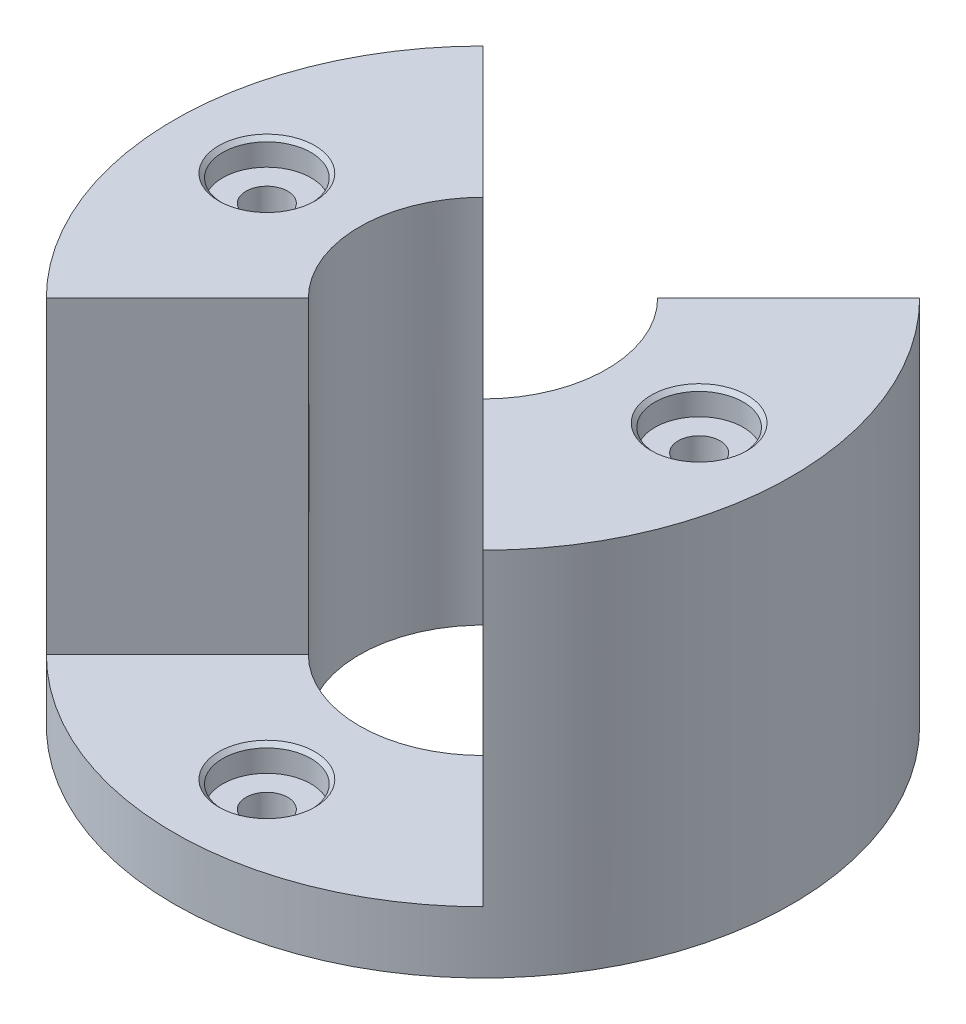
ISO-10303-21;
HEADER;
FILE_DESCRIPTION(('STEP AP214'),'2;1');
FILE_NAME('part.step','',(''),(''),'','','');
FILE_SCHEMA(('AUTOMOTIVE_DESIGN { 1 0 10303 214 1 1 1 1 }'));
ENDSEC;
DATA;
#1=APPLICATION_CONTEXT('core data for automotive mechanical design processes');
#2=APPLICATION_PROTOCOL_DEFINITION('international standard','automotive_design',2000,#1);
#3=PRODUCT_CONTEXT('',#1,'mechanical');
#4=PRODUCT('Part','Part','',(#3));
#5=PRODUCT_RELATED_PRODUCT_CATEGORY('part','',(#4));
#6=PRODUCT_DEFINITION_FORMATION('','',#4);
#7=PRODUCT_DEFINITION_CONTEXT('part definition',#1,'design');
#8=PRODUCT_DEFINITION('design','',#6,#7);
#9=PRODUCT_DEFINITION_SHAPE('','',#8);
#10=(LENGTH_UNIT() NAMED_UNIT(*) SI_UNIT(.MILLI.,.METRE.));
#11=(NAMED_UNIT(*) PLANE_ANGLE_UNIT() SI_UNIT($,.RADIAN.));
#12=(NAMED_UNIT(*) SI_UNIT($,.STERADIAN.) SOLID_ANGLE_UNIT());
#13=UNCERTAINTY_MEASURE_WITH_UNIT(LENGTH_MEASURE(1.E-05),#10,'distance_accuracy_value','');
#14=(GEOMETRIC_REPRESENTATION_CONTEXT(3) GLOBAL_UNCERTAINTY_ASSIGNED_CONTEXT((#13)) GLOBAL_UNIT_ASSIGNED_CONTEXT((#10,
#11,#12)) REPRESENTATION_CONTEXT('',''));
#15=CARTESIAN_POINT('',(0.,0.,0.));
#16=DIRECTION('',(0.,0.,1.));
#17=DIRECTION('',(1.,0.,0.));
#18=AXIS2_PLACEMENT_3D('',#15,#16,#17);
#19=CARTESIAN_POINT('',(0.,10.,0.));
#20=DIRECTION('',(0.,1.,0.));
#21=DIRECTION('',(0.,0.,1.));
#22=AXIS2_PLACEMENT_3D('',#19,#20,#21);
#23=PLANE('',#22);
#24=CARTESIAN_POINT('',(0.,10.,-35.));
#25=DIRECTION('',(0.,1.,0.));
#26=DIRECTION('',(0.,0.,1.));
#27=AXIS2_PLACEMENT_3D('',#24,#25,#26);
#28=CIRCLE('',#27,7.78);
#29=CARTESIAN_POINT('',(0.,10.,-27.22));
#30=VERTEX_POINT('',#29);
#31=EDGE_CURVE('E328',#30,#30,#28,.T.);
#32=ORIENTED_EDGE('',*,*,#31,.F.);
#33=EDGE_LOOP('',(#32));
#34=FACE_BOUND('',#33,.T.);
#35=CARTESIAN_POINT('',(0.,10.,0.));
#36=DIRECTION('',(0.,1.,0.));
#37=DIRECTION('',(0.,0.,1.));
#38=AXIS2_PLACEMENT_3D('',#35,#36,#37);
#39=CIRCLE('',#38,50.);
#40=CARTESIAN_POINT('',(35.3553390593273,10.,-35.3553390593274));
#41=VERTEX_POINT('',#40);
#42=CARTESIAN_POINT('',(-35.3553390593273,10.,-35.3553390593274));
#43=VERTEX_POINT('',#42);
#44=EDGE_CURVE('E11',#41,#43,#39,.T.);
#45=ORIENTED_EDGE('',*,*,#44,.T.);
#46=DIRECTION('',(-0.707106781186546,0.,-0.707106781186549));
#47=VECTOR('',#46,1.);
#48=CARTESIAN_POINT('',(0.,10.,0.));
#49=LINE('',#48,#47);
#50=CARTESIAN_POINT('',(-14.1421356237309,10.,-14.142135623731));
#51=VERTEX_POINT('',#50);
#52=EDGE_CURVE('E130',#51,#43,#49,.T.);
#53=ORIENTED_EDGE('',*,*,#52,.F.);
#54=CARTESIAN_POINT('',(0.,10.,0.));
#55=DIRECTION('',(0.,1.,0.));
#56=DIRECTION('',(0.,0.,1.));
#57=AXIS2_PLACEMENT_3D('',#54,#55,#56);
#58=CIRCLE('',#57,20.);
#59=CARTESIAN_POINT('',(14.1421356237309,10.,-14.142135623731));
#60=VERTEX_POINT('',#59);
#61=EDGE_CURVE('E193',#60,#51,#58,.T.);
#62=ORIENTED_EDGE('',*,*,#61,.F.);
#63=DIRECTION('',(0.707106781186546,0.,-0.707106781186549));
#64=VECTOR('',#63,1.);
#65=CARTESIAN_POINT('',(0.,10.,0.));
#66=LINE('',#65,#64);
#67=EDGE_CURVE('E65',#60,#41,#66,.T.);
#68=ORIENTED_EDGE('',*,*,#67,.T.);
#69=EDGE_LOOP('',(#45,#53,#62,#68));
#70=FACE_BOUND('',#69,.T.);
#71=ADVANCED_FACE('F41',(#34,#70),#23,.T.);
#72=CARTESIAN_POINT('',(0.,10.,35.));
#73=DIRECTION('',(0.,1.,0.));
#74=DIRECTION('',(0.,0.,1.));
#75=AXIS2_PLACEMENT_3D('',#72,#73,#74);
#76=CIRCLE('',#75,7.78);
#77=CARTESIAN_POINT('',(0.,10.,42.78));
#78=VERTEX_POINT('',#77);
#79=EDGE_CURVE('E345',#78,#78,#76,.T.);
#80=ORIENTED_EDGE('',*,*,#79,.F.);
#81=EDGE_LOOP('',(#80));
#82=FACE_BOUND('',#81,.T.);
#83=DIRECTION('',(-0.707106781186546,0.,0.707106781186549));
#84=VECTOR('',#83,1.);
#85=CARTESIAN_POINT('',(0.,10.,0.));
#86=LINE('',#85,#84);
#87=CARTESIAN_POINT('',(-14.1421356237309,10.,14.142135623731));
#88=VERTEX_POINT('',#87);
#89=CARTESIAN_POINT('',(-35.3553390593273,10.,35.3553390593274));
#90=VERTEX_POINT('',#89);
#91=EDGE_CURVE('E58',#88,#90,#86,.T.);
#92=ORIENTED_EDGE('',*,*,#91,.T.);
#93=CARTESIAN_POINT('',(35.3553390593273,10.,35.3553390593274));
#94=VERTEX_POINT('',#93);
#95=EDGE_CURVE('E51',#90,#94,#39,.T.);
#96=ORIENTED_EDGE('',*,*,#95,.T.);
#97=DIRECTION('',(0.707106781186546,0.,0.707106781186549));
#98=VECTOR('',#97,1.);
#99=CARTESIAN_POINT('',(0.,10.,0.));
#100=LINE('',#99,#98);
#101=CARTESIAN_POINT('',(14.1421356237309,10.,14.142135623731));
#102=VERTEX_POINT('',#101);
#103=EDGE_CURVE('E158',#102,#94,#100,.T.);
#104=ORIENTED_EDGE('',*,*,#103,.F.);
#105=EDGE_CURVE('E188',#88,#102,#58,.T.);
#106=ORIENTED_EDGE('',*,*,#105,.F.);
#107=EDGE_LOOP('',(#92,#96,#104,#106));
#108=FACE_BOUND('',#107,.T.);
#109=ADVANCED_FACE('F201',(#82,#108),#23,.T.);
#110=CARTESIAN_POINT('',(0.,10.,0.));
#111=DIRECTION('',(0.,-1.,0.));
#112=DIRECTION('',(0.,0.,-1.));
#113=AXIS2_PLACEMENT_3D('',#110,#111,#112);
#114=CYLINDRICAL_SURFACE('',#113,50.);
#115=ORIENTED_EDGE('',*,*,#44,.F.);
#116=DIRECTION('',(0.,-1.,0.));
#117=VECTOR('',#116,1.);
#118=CARTESIAN_POINT('',(35.3553390593273,60.,-35.3553390593274));
#119=LINE('',#118,#117);
#120=CARTESIAN_POINT('',(35.3553390593273,60.,-35.3553390593274));
#121=VERTEX_POINT('',#120);
#122=EDGE_CURVE('E167',#121,#41,#119,.T.);
#123=ORIENTED_EDGE('',*,*,#122,.F.);
#124=CARTESIAN_POINT('',(0.,60.,0.));
#125=DIRECTION('',(0.,1.,0.));
#126=DIRECTION('',(0.,0.,1.));
#127=AXIS2_PLACEMENT_3D('',#124,#125,#126);
#128=CIRCLE('',#127,50.);
#129=CARTESIAN_POINT('',(35.3553390593273,60.,35.3553390593274));
#130=VERTEX_POINT('',#129);
#131=EDGE_CURVE('E164',#130,#121,#128,.T.);
#132=ORIENTED_EDGE('',*,*,#131,.F.);
#133=DIRECTION('',(0.,-1.,0.));
#134=VECTOR('',#133,1.);
#135=CARTESIAN_POINT('',(35.3553390593273,60.,35.3553390593274));
#136=LINE('',#135,#134);
#137=EDGE_CURVE('E176',#130,#94,#136,.T.);
#138=ORIENTED_EDGE('',*,*,#137,.T.);
#139=ORIENTED_EDGE('',*,*,#95,.F.);
#140=DIRECTION('',(0.,-1.,0.));
#141=VECTOR('',#140,1.);
#142=CARTESIAN_POINT('',(-35.3553390593273,60.,35.3553390593274));
#143=LINE('',#142,#141);
#144=CARTESIAN_POINT('',(-35.3553390593273,60.,35.3553390593274));
#145=VERTEX_POINT('',#144);
#146=EDGE_CURVE('E142',#145,#90,#143,.T.);
#147=ORIENTED_EDGE('',*,*,#146,.F.);
#148=CARTESIAN_POINT('',(0.,60.,0.));
#149=DIRECTION('',(0.,1.,0.));
#150=DIRECTION('',(0.,0.,1.));
#151=AXIS2_PLACEMENT_3D('',#148,#149,#150);
#152=CIRCLE('',#151,50.);
#153=CARTESIAN_POINT('',(-35.3553390593273,60.,-35.3553390593274));
#154=VERTEX_POINT('',#153);
#155=EDGE_CURVE('E127',#154,#145,#152,.T.);
#156=ORIENTED_EDGE('',*,*,#155,.F.);
#157=DIRECTION('',(0.,-1.,0.));
#158=VECTOR('',#157,1.);
#159=CARTESIAN_POINT('',(-35.3553390593273,60.,-35.3553390593274));
#160=LINE('',#159,#158);
#161=EDGE_CURVE('E147',#154,#43,#160,.T.);
#162=ORIENTED_EDGE('',*,*,#161,.T.);
#163=EDGE_LOOP('',(#115,#123,#132,#138,#139,#147,#156,#162));
#164=FACE_BOUND('',#163,.T.);
#165=CARTESIAN_POINT('',(0.,0.,0.));
#166=DIRECTION('',(0.,1.,0.));
#167=DIRECTION('',(0.,0.,1.));
#168=AXIS2_PLACEMENT_3D('',#165,#166,#167);
#169=CIRCLE('',#168,50.);
#170=CARTESIAN_POINT('',(0.,0.,50.));
#171=VERTEX_POINT('',#170);
#172=EDGE_CURVE('E45',#171,#171,#169,.T.);
#173=ORIENTED_EDGE('',*,*,#172,.T.);
#174=EDGE_LOOP('',(#173));
#175=FACE_BOUND('',#174,.T.);
#176=ADVANCED_FACE('F43',(#164,#175),#114,.T.);
#177=CARTESIAN_POINT('',(0.,0.,0.));
#178=DIRECTION('',(0.,1.,0.));
#179=DIRECTION('',(0.,0.,1.));
#180=AXIS2_PLACEMENT_3D('',#177,#178,#179);
#181=PLANE('',#180);
#182=CARTESIAN_POINT('',(0.,0.,-35.));
#183=DIRECTION('',(0.,1.,0.));
#184=DIRECTION('',(0.,0.,1.));
#185=AXIS2_PLACEMENT_3D('',#182,#183,#184);
#186=CIRCLE('',#185,3.38);
#187=CARTESIAN_POINT('',(0.,0.,-31.62));
#188=VERTEX_POINT('',#187);
#189=EDGE_CURVE('E342',#188,#188,#186,.T.);
#190=ORIENTED_EDGE('',*,*,#189,.T.);
#191=EDGE_LOOP('',(#190));
#192=FACE_BOUND('',#191,.T.);
#193=CARTESIAN_POINT('',(0.,0.,35.));
#194=DIRECTION('',(0.,1.,0.));
#195=DIRECTION('',(0.,0.,1.));
#196=AXIS2_PLACEMENT_3D('',#193,#194,#195);
#197=CIRCLE('',#196,3.38);
#198=CARTESIAN_POINT('',(0.,0.,38.38));
#199=VERTEX_POINT('',#198);
#200=EDGE_CURVE('E361',#199,#199,#197,.T.);
#201=ORIENTED_EDGE('',*,*,#200,.T.);
#202=EDGE_LOOP('',(#201));
#203=FACE_BOUND('',#202,.T.);
#204=CARTESIAN_POINT('',(-35.,0.,0.));
#205=DIRECTION('',(0.,1.,0.));
#206=DIRECTION('',(0.,0.,1.));
#207=AXIS2_PLACEMENT_3D('',#204,#205,#206);
#208=CIRCLE('',#207,3.37999999999999);
#209=CARTESIAN_POINT('',(-35.,0.,3.37999999999999));
#210=VERTEX_POINT('',#209);
#211=EDGE_CURVE('E381',#210,#210,#208,.T.);
#212=ORIENTED_EDGE('',*,*,#211,.T.);
#213=EDGE_LOOP('',(#212));
#214=FACE_BOUND('',#213,.T.);
#215=CARTESIAN_POINT('',(35.,0.,0.));
#216=DIRECTION('',(0.,1.,0.));
#217=DIRECTION('',(0.,0.,1.));
#218=AXIS2_PLACEMENT_3D('',#215,#216,#217);
#219=CIRCLE('',#218,3.37999999999999);
#220=CARTESIAN_POINT('',(35.,0.,3.37999999999999));
#221=VERTEX_POINT('',#220);
#222=EDGE_CURVE('E135',#221,#221,#219,.T.);
#223=ORIENTED_EDGE('',*,*,#222,.T.);
#224=EDGE_LOOP('',(#223));
#225=FACE_BOUND('',#224,.T.);
#226=CARTESIAN_POINT('',(0.,0.,0.));
#227=DIRECTION('',(0.,1.,0.));
#228=DIRECTION('',(0.,0.,1.));
#229=AXIS2_PLACEMENT_3D('',#226,#227,#228);
#230=CIRCLE('',#229,20.);
#231=CARTESIAN_POINT('',(0.,0.,20.));
#232=VERTEX_POINT('',#231);
#233=EDGE_CURVE('E189',#232,#232,#230,.T.);
#234=ORIENTED_EDGE('',*,*,#233,.T.);
#235=EDGE_LOOP('',(#234));
#236=FACE_BOUND('',#235,.T.);
#237=ORIENTED_EDGE('',*,*,#172,.F.);
#238=EDGE_LOOP('',(#237));
#239=FACE_BOUND('',#238,.T.);
#240=ADVANCED_FACE('F224',(#192,#203,#214,#225,#236,#239),#181,.F.);
#241=CARTESIAN_POINT('',(0.,0.,0.));
#242=DIRECTION('',(0.,1.,0.));
#243=DIRECTION('',(0.,0.,1.));
#244=AXIS2_PLACEMENT_3D('',#241,#242,#243);
#245=CYLINDRICAL_SURFACE('',#244,20.);
#246=ORIENTED_EDGE('',*,*,#233,.F.);
#247=EDGE_LOOP('',(#246));
#248=FACE_BOUND('',#247,.T.);
#249=ORIENTED_EDGE('',*,*,#61,.T.);
#250=DIRECTION('',(0.,-1.,0.));
#251=VECTOR('',#250,1.);
#252=CARTESIAN_POINT('',(-14.1421356237309,60.,-14.142135623731));
#253=LINE('',#252,#251);
#254=CARTESIAN_POINT('',(-14.1421356237309,60.,-14.142135623731));
#255=VERTEX_POINT('',#254);
#256=EDGE_CURVE('E114',#255,#51,#253,.T.);
#257=ORIENTED_EDGE('',*,*,#256,.F.);
#258=CARTESIAN_POINT('',(0.,60.,0.));
#259=DIRECTION('',(0.,1.,0.));
#260=DIRECTION('',(0.,0.,1.));
#261=AXIS2_PLACEMENT_3D('',#258,#259,#260);
#262=CIRCLE('',#261,20.);
#263=CARTESIAN_POINT('',(-14.1421356237309,60.,14.142135623731));
#264=VERTEX_POINT('',#263);
#265=EDGE_CURVE('E117',#264,#255,#262,.F.);
#266=ORIENTED_EDGE('',*,*,#265,.F.);
#267=DIRECTION('',(0.,-1.,0.));
#268=VECTOR('',#267,1.);
#269=CARTESIAN_POINT('',(-14.1421356237309,60.,14.142135623731));
#270=LINE('',#269,#268);
#271=EDGE_CURVE('E106',#264,#88,#270,.T.);
#272=ORIENTED_EDGE('',*,*,#271,.T.);
#273=ORIENTED_EDGE('',*,*,#105,.T.);
#274=DIRECTION('',(0.,-1.,0.));
#275=VECTOR('',#274,1.);
#276=CARTESIAN_POINT('',(14.1421356237309,60.,14.142135623731));
#277=LINE('',#276,#275);
#278=CARTESIAN_POINT('',(14.1421356237309,60.,14.142135623731));
#279=VERTEX_POINT('',#278);
#280=EDGE_CURVE('E180',#279,#102,#277,.T.);
#281=ORIENTED_EDGE('',*,*,#280,.F.);
#282=CARTESIAN_POINT('',(0.,60.,0.));
#283=DIRECTION('',(0.,1.,0.));
#284=DIRECTION('',(0.,0.,1.));
#285=AXIS2_PLACEMENT_3D('',#282,#283,#284);
#286=CIRCLE('',#285,20.);
#287=CARTESIAN_POINT('',(14.1421356237309,60.,-14.142135623731));
#288=VERTEX_POINT('',#287);
#289=EDGE_CURVE('E157',#288,#279,#286,.F.);
#290=ORIENTED_EDGE('',*,*,#289,.F.);
#291=DIRECTION('',(0.,-1.,0.));
#292=VECTOR('',#291,1.);
#293=CARTESIAN_POINT('',(14.1421356237309,60.,-14.142135623731));
#294=LINE('',#293,#292);
#295=EDGE_CURVE('E184',#288,#60,#294,.T.);
#296=ORIENTED_EDGE('',*,*,#295,.T.);
#297=EDGE_LOOP('',(#249,#257,#266,#272,#273,#281,#290,#296));
#298=FACE_BOUND('',#297,.T.);
#299=ADVANCED_FACE('F119',(#248,#298),#245,.F.);
#300=CARTESIAN_POINT('',(0.,60.,0.));
#301=DIRECTION('',(-0.707106781186549,0.,-0.707106781186546));
#302=DIRECTION('',(-0.707106781186546,0.,0.707106781186549));
#303=AXIS2_PLACEMENT_3D('',#300,#301,#302);
#304=PLANE('',#303);
#305=ORIENTED_EDGE('',*,*,#67,.F.);
#306=ORIENTED_EDGE('',*,*,#295,.F.);
#307=DIRECTION('',(0.707106781186546,0.,-0.707106781186549));
#308=VECTOR('',#307,1.);
#309=CARTESIAN_POINT('',(0.,60.,0.));
#310=LINE('',#309,#308);
#311=EDGE_CURVE('E153',#288,#121,#310,.T.);
#312=ORIENTED_EDGE('',*,*,#311,.T.);
#313=ORIENTED_EDGE('',*,*,#122,.T.);
#314=EDGE_LOOP('',(#305,#306,#312,#313));
#315=FACE_BOUND('',#314,.T.);
#316=ADVANCED_FACE('F212',(#315),#304,.T.);
#317=CARTESIAN_POINT('',(0.,60.,0.));
#318=DIRECTION('',(0.707106781186549,0.,-0.707106781186546));
#319=DIRECTION('',(-0.707106781186546,0.,-0.707106781186549));
#320=AXIS2_PLACEMENT_3D('',#317,#318,#319);
#321=PLANE('',#320);
#322=ORIENTED_EDGE('',*,*,#103,.T.);
#323=ORIENTED_EDGE('',*,*,#137,.F.);
#324=DIRECTION('',(0.707106781186546,0.,0.707106781186549));
#325=VECTOR('',#324,1.);
#326=CARTESIAN_POINT('',(0.,60.,0.));
#327=LINE('',#326,#325);
#328=EDGE_CURVE('E161',#279,#130,#327,.T.);
#329=ORIENTED_EDGE('',*,*,#328,.F.);
#330=ORIENTED_EDGE('',*,*,#280,.T.);
#331=EDGE_LOOP('',(#322,#323,#329,#330));
#332=FACE_BOUND('',#331,.T.);
#333=ADVANCED_FACE('F205',(#332),#321,.F.);
#334=CARTESIAN_POINT('',(0.,60.,0.));
#335=DIRECTION('',(0.,1.,0.));
#336=DIRECTION('',(0.,0.,1.));
#337=AXIS2_PLACEMENT_3D('',#334,#335,#336);
#338=PLANE('',#337);
#339=CARTESIAN_POINT('',(35.,60.,0.));
#340=DIRECTION('',(0.,1.,0.));
#341=DIRECTION('',(0.,0.,1.));
#342=AXIS2_PLACEMENT_3D('',#339,#340,#341);
#343=CIRCLE('',#342,7.78);
#344=CARTESIAN_POINT('',(35.,60.,7.78));
#345=VERTEX_POINT('',#344);
#346=EDGE_CURVE('E385',#345,#345,#343,.T.);
#347=ORIENTED_EDGE('',*,*,#346,.F.);
#348=EDGE_LOOP('',(#347));
#349=FACE_BOUND('',#348,.T.);
#350=ORIENTED_EDGE('',*,*,#311,.F.);
#351=ORIENTED_EDGE('',*,*,#289,.T.);
#352=ORIENTED_EDGE('',*,*,#328,.T.);
#353=ORIENTED_EDGE('',*,*,#131,.T.);
#354=EDGE_LOOP('',(#350,#351,#352,#353));
#355=FACE_BOUND('',#354,.T.);
#356=ADVANCED_FACE('F209',(#349,#355),#338,.T.);
#357=CARTESIAN_POINT('',(0.,60.,0.));
#358=DIRECTION('',(0.707106781186549,0.,0.707106781186546));
#359=DIRECTION('',(0.707106781186546,0.,-0.707106781186549));
#360=AXIS2_PLACEMENT_3D('',#357,#358,#359);
#361=PLANE('',#360);
#362=ORIENTED_EDGE('',*,*,#91,.F.);
#363=ORIENTED_EDGE('',*,*,#271,.F.);
#364=DIRECTION('',(-0.707106781186546,0.,0.707106781186549));
#365=VECTOR('',#364,1.);
#366=CARTESIAN_POINT('',(0.,60.,0.));
#367=LINE('',#366,#365);
#368=EDGE_CURVE('E110',#264,#145,#367,.T.);
#369=ORIENTED_EDGE('',*,*,#368,.T.);
#370=ORIENTED_EDGE('',*,*,#146,.T.);
#371=EDGE_LOOP('',(#362,#363,#369,#370));
#372=FACE_BOUND('',#371,.T.);
#373=ADVANCED_FACE('F108',(#372),#361,.T.);
#374=CARTESIAN_POINT('',(0.,60.,0.));
#375=DIRECTION('',(-0.707106781186549,0.,0.707106781186546));
#376=DIRECTION('',(0.707106781186546,0.,0.707106781186549));
#377=AXIS2_PLACEMENT_3D('',#374,#375,#376);
#378=PLANE('',#377);
#379=ORIENTED_EDGE('',*,*,#52,.T.);
#380=ORIENTED_EDGE('',*,*,#161,.F.);
#381=DIRECTION('',(-0.707106781186546,0.,-0.707106781186549));
#382=VECTOR('',#381,1.);
#383=CARTESIAN_POINT('',(0.,60.,0.));
#384=LINE('',#383,#382);
#385=EDGE_CURVE('E123',#255,#154,#384,.T.);
#386=ORIENTED_EDGE('',*,*,#385,.F.);
#387=ORIENTED_EDGE('',*,*,#256,.T.);
#388=EDGE_LOOP('',(#379,#380,#386,#387));
#389=FACE_BOUND('',#388,.T.);
#390=ADVANCED_FACE('F218',(#389),#378,.F.);
#391=CARTESIAN_POINT('',(0.,60.,0.));
#392=DIRECTION('',(0.,1.,0.));
#393=DIRECTION('',(0.,0.,1.));
#394=AXIS2_PLACEMENT_3D('',#391,#392,#393);
#395=PLANE('',#394);
#396=CARTESIAN_POINT('',(-35.,60.,0.));
#397=DIRECTION('',(0.,1.,0.));
#398=DIRECTION('',(0.,0.,1.));
#399=AXIS2_PLACEMENT_3D('',#396,#397,#398);
#400=CIRCLE('',#399,7.78);
#401=CARTESIAN_POINT('',(-35.,60.,7.78));
#402=VERTEX_POINT('',#401);
#403=EDGE_CURVE('E365',#402,#402,#400,.T.);
#404=ORIENTED_EDGE('',*,*,#403,.F.);
#405=EDGE_LOOP('',(#404));
#406=FACE_BOUND('',#405,.T.);
#407=ORIENTED_EDGE('',*,*,#368,.F.);
#408=ORIENTED_EDGE('',*,*,#265,.T.);
#409=ORIENTED_EDGE('',*,*,#385,.T.);
#410=ORIENTED_EDGE('',*,*,#155,.T.);
#411=EDGE_LOOP('',(#407,#408,#409,#410));
#412=FACE_BOUND('',#411,.T.);
#413=ADVANCED_FACE('F125',(#406,#412),#395,.T.);
#414=CARTESIAN_POINT('',(35.,60.,0.));
#415=DIRECTION('',(0.,1.,0.));
#416=DIRECTION('',(0.,0.,1.));
#417=AXIS2_PLACEMENT_3D('',#414,#415,#416);
#418=CYLINDRICAL_SURFACE('',#417,3.37999999999999);
#419=ORIENTED_EDGE('',*,*,#222,.F.);
#420=EDGE_LOOP('',(#419));
#421=FACE_BOUND('',#420,.T.);
#422=CARTESIAN_POINT('',(35.,55.81,0.));
#423=DIRECTION('',(0.,1.,0.));
#424=DIRECTION('',(0.,0.,1.));
#425=AXIS2_PLACEMENT_3D('',#422,#423,#424);
#426=CIRCLE('',#425,3.38);
#427=CARTESIAN_POINT('',(35.,55.81,3.38));
#428=VERTEX_POINT('',#427);
#429=EDGE_CURVE('E396',#428,#428,#426,.T.);
#430=ORIENTED_EDGE('',*,*,#429,.T.);
#431=EDGE_LOOP('',(#430));
#432=FACE_BOUND('',#431,.T.);
#433=ADVANCED_FACE('F257',(#421,#432),#418,.F.);
#434=CARTESIAN_POINT('',(42.145,55.81,0.));
#435=DIRECTION('',(0.,-1.,0.));
#436=DIRECTION('',(0.,0.,-1.));
#437=AXIS2_PLACEMENT_3D('',#434,#435,#436);
#438=PLANE('',#437);
#439=ORIENTED_EDGE('',*,*,#429,.F.);
#440=EDGE_LOOP('',(#439));
#441=FACE_BOUND('',#440,.T.);
#442=CARTESIAN_POINT('',(35.,55.81,0.));
#443=DIRECTION('',(0.,1.,0.));
#444=DIRECTION('',(0.,0.,1.));
#445=AXIS2_PLACEMENT_3D('',#442,#443,#444);
#446=CIRCLE('',#445,7.145);
#447=CARTESIAN_POINT('',(35.,55.81,7.145));
#448=VERTEX_POINT('',#447);
#449=EDGE_CURVE('E393',#448,#448,#446,.T.);
#450=ORIENTED_EDGE('',*,*,#449,.T.);
#451=EDGE_LOOP('',(#450));
#452=FACE_BOUND('',#451,.T.);
#453=ADVANCED_FACE('F261',(#441,#452),#438,.F.);
#454=CARTESIAN_POINT('',(35.,60.,0.));
#455=DIRECTION('',(0.,1.,0.));
#456=DIRECTION('',(0.,0.,1.));
#457=AXIS2_PLACEMENT_3D('',#454,#455,#456);
#458=CYLINDRICAL_SURFACE('',#457,7.145);
#459=ORIENTED_EDGE('',*,*,#449,.F.);
#460=EDGE_LOOP('',(#459));
#461=FACE_BOUND('',#460,.T.);
#462=CARTESIAN_POINT('',(35.,59.365,0.));
#463=DIRECTION('',(0.,1.,0.));
#464=DIRECTION('',(0.,0.,1.));
#465=AXIS2_PLACEMENT_3D('',#462,#463,#464);
#466=CIRCLE('',#465,7.145);
#467=CARTESIAN_POINT('',(35.,59.365,7.145));
#468=VERTEX_POINT('',#467);
#469=EDGE_CURVE('E389',#468,#468,#466,.T.);
#470=ORIENTED_EDGE('',*,*,#469,.T.);
#471=EDGE_LOOP('',(#470));
#472=FACE_BOUND('',#471,.T.);
#473=ADVANCED_FACE('F265',(#461,#472),#458,.F.);
#474=CARTESIAN_POINT('',(35.,60.,0.));
#475=DIRECTION('',(0.,1.,0.));
#476=DIRECTION('',(0.,0.,1.));
#477=AXIS2_PLACEMENT_3D('',#474,#475,#476);
#478=CONICAL_SURFACE('',#477,7.78,0.785398163397448);
#479=ORIENTED_EDGE('',*,*,#469,.F.);
#480=EDGE_LOOP('',(#479));
#481=FACE_BOUND('',#480,.T.);
#482=ORIENTED_EDGE('',*,*,#346,.T.);
#483=EDGE_LOOP('',(#482));
#484=FACE_BOUND('',#483,.T.);
#485=ADVANCED_FACE('F269',(#481,#484),#478,.F.);
#486=CARTESIAN_POINT('',(-35.,60.,0.));
#487=DIRECTION('',(0.,1.,0.));
#488=DIRECTION('',(0.,0.,1.));
#489=AXIS2_PLACEMENT_3D('',#486,#487,#488);
#490=CYLINDRICAL_SURFACE('',#489,3.37999999999999);
#491=ORIENTED_EDGE('',*,*,#211,.F.);
#492=EDGE_LOOP('',(#491));
#493=FACE_BOUND('',#492,.T.);
#494=CARTESIAN_POINT('',(-35.,55.81,0.));
#495=DIRECTION('',(0.,1.,0.));
#496=DIRECTION('',(0.,0.,1.));
#497=AXIS2_PLACEMENT_3D('',#494,#495,#496);
#498=CIRCLE('',#497,3.38);
#499=CARTESIAN_POINT('',(-35.,55.81,3.38));
#500=VERTEX_POINT('',#499);
#501=EDGE_CURVE('E377',#500,#500,#498,.T.);
#502=ORIENTED_EDGE('',*,*,#501,.T.);
#503=EDGE_LOOP('',(#502));
#504=FACE_BOUND('',#503,.T.);
#505=ADVANCED_FACE('F273',(#493,#504),#490,.F.);
#506=CARTESIAN_POINT('',(-27.855,55.81,0.));
#507=DIRECTION('',(0.,-1.,0.));
#508=DIRECTION('',(0.,0.,-1.));
#509=AXIS2_PLACEMENT_3D('',#506,#507,#508);
#510=PLANE('',#509);
#511=ORIENTED_EDGE('',*,*,#501,.F.);
#512=EDGE_LOOP('',(#511));
#513=FACE_BOUND('',#512,.T.);
#514=CARTESIAN_POINT('',(-35.,55.81,0.));
#515=DIRECTION('',(0.,1.,0.));
#516=DIRECTION('',(0.,0.,1.));
#517=AXIS2_PLACEMENT_3D('',#514,#515,#516);
#518=CIRCLE('',#517,7.145);
#519=CARTESIAN_POINT('',(-35.,55.81,7.145));
#520=VERTEX_POINT('',#519);
#521=EDGE_CURVE('E373',#520,#520,#518,.T.);
#522=ORIENTED_EDGE('',*,*,#521,.T.);
#523=EDGE_LOOP('',(#522));
#524=FACE_BOUND('',#523,.T.);
#525=ADVANCED_FACE('F277',(#513,#524),#510,.F.);
#526=CARTESIAN_POINT('',(-35.,60.,0.));
#527=DIRECTION('',(0.,1.,0.));
#528=DIRECTION('',(0.,0.,1.));
#529=AXIS2_PLACEMENT_3D('',#526,#527,#528);
#530=CYLINDRICAL_SURFACE('',#529,7.145);
#531=ORIENTED_EDGE('',*,*,#521,.F.);
#532=EDGE_LOOP('',(#531));
#533=FACE_BOUND('',#532,.T.);
#534=CARTESIAN_POINT('',(-35.,59.365,0.));
#535=DIRECTION('',(0.,1.,0.));
#536=DIRECTION('',(0.,0.,1.));
#537=AXIS2_PLACEMENT_3D('',#534,#535,#536);
#538=CIRCLE('',#537,7.145);
#539=CARTESIAN_POINT('',(-35.,59.365,7.145));
#540=VERTEX_POINT('',#539);
#541=EDGE_CURVE('E369',#540,#540,#538,.T.);
#542=ORIENTED_EDGE('',*,*,#541,.T.);
#543=EDGE_LOOP('',(#542));
#544=FACE_BOUND('',#543,.T.);
#545=ADVANCED_FACE('F281',(#533,#544),#530,.F.);
#546=CARTESIAN_POINT('',(-35.,60.,0.));
#547=DIRECTION('',(0.,1.,0.));
#548=DIRECTION('',(0.,0.,1.));
#549=AXIS2_PLACEMENT_3D('',#546,#547,#548);
#550=CONICAL_SURFACE('',#549,7.78,0.785398163397448);
#551=ORIENTED_EDGE('',*,*,#541,.F.);
#552=EDGE_LOOP('',(#551));
#553=FACE_BOUND('',#552,.T.);
#554=ORIENTED_EDGE('',*,*,#403,.T.);
#555=EDGE_LOOP('',(#554));
#556=FACE_BOUND('',#555,.T.);
#557=ADVANCED_FACE('F285',(#553,#556),#550,.F.);
#558=CARTESIAN_POINT('',(0.,10.,35.));
#559=DIRECTION('',(0.,1.,0.));
#560=DIRECTION('',(0.,0.,1.));
#561=AXIS2_PLACEMENT_3D('',#558,#559,#560);
#562=CYLINDRICAL_SURFACE('',#561,3.38);
#563=ORIENTED_EDGE('',*,*,#200,.F.);
#564=EDGE_LOOP('',(#563));
#565=FACE_BOUND('',#564,.T.);
#566=CARTESIAN_POINT('',(0.,5.81000000000001,35.));
#567=DIRECTION('',(0.,1.,0.));
#568=DIRECTION('',(0.,0.,1.));
#569=AXIS2_PLACEMENT_3D('',#566,#567,#568);
#570=CIRCLE('',#569,3.38000000000001);
#571=CARTESIAN_POINT('',(0.,5.81000000000001,38.38));
#572=VERTEX_POINT('',#571);
#573=EDGE_CURVE('E357',#572,#572,#570,.T.);
#574=ORIENTED_EDGE('',*,*,#573,.T.);
#575=EDGE_LOOP('',(#574));
#576=FACE_BOUND('',#575,.T.);
#577=ADVANCED_FACE('F289',(#565,#576),#562,.F.);
#578=CARTESIAN_POINT('',(7.145,5.81000000000001,35.));
#579=DIRECTION('',(0.,-1.,0.));
#580=DIRECTION('',(0.,0.,-1.));
#581=AXIS2_PLACEMENT_3D('',#578,#579,#580);
#582=PLANE('',#581);
#583=ORIENTED_EDGE('',*,*,#573,.F.);
#584=EDGE_LOOP('',(#583));
#585=FACE_BOUND('',#584,.T.);
#586=CARTESIAN_POINT('',(0.,5.81000000000001,35.));
#587=DIRECTION('',(0.,1.,0.));
#588=DIRECTION('',(0.,0.,1.));
#589=AXIS2_PLACEMENT_3D('',#586,#587,#588);
#590=CIRCLE('',#589,7.145);
#591=CARTESIAN_POINT('',(0.,5.81000000000001,42.145));
#592=VERTEX_POINT('',#591);
#593=EDGE_CURVE('E353',#592,#592,#590,.T.);
#594=ORIENTED_EDGE('',*,*,#593,.T.);
#595=EDGE_LOOP('',(#594));
#596=FACE_BOUND('',#595,.T.);
#597=ADVANCED_FACE('F293',(#585,#596),#582,.F.);
#598=CARTESIAN_POINT('',(0.,10.,35.));
#599=DIRECTION('',(0.,1.,0.));
#600=DIRECTION('',(0.,0.,1.));
#601=AXIS2_PLACEMENT_3D('',#598,#599,#600);
#602=CYLINDRICAL_SURFACE('',#601,7.145);
#603=ORIENTED_EDGE('',*,*,#593,.F.);
#604=EDGE_LOOP('',(#603));
#605=FACE_BOUND('',#604,.T.);
#606=CARTESIAN_POINT('',(0.,9.365,35.));
#607=DIRECTION('',(0.,1.,0.));
#608=DIRECTION('',(0.,0.,1.));
#609=AXIS2_PLACEMENT_3D('',#606,#607,#608);
#610=CIRCLE('',#609,7.145);
#611=CARTESIAN_POINT('',(0.,9.365,42.145));
#612=VERTEX_POINT('',#611);
#613=EDGE_CURVE('E349',#612,#612,#610,.T.);
#614=ORIENTED_EDGE('',*,*,#613,.T.);
#615=EDGE_LOOP('',(#614));
#616=FACE_BOUND('',#615,.T.);
#617=ADVANCED_FACE('F297',(#605,#616),#602,.F.);
#618=CARTESIAN_POINT('',(0.,10.,35.));
#619=DIRECTION('',(0.,1.,0.));
#620=DIRECTION('',(0.,0.,1.));
#621=AXIS2_PLACEMENT_3D('',#618,#619,#620);
#622=CONICAL_SURFACE('',#621,7.78,0.78539816339745);
#623=ORIENTED_EDGE('',*,*,#613,.F.);
#624=EDGE_LOOP('',(#623));
#625=FACE_BOUND('',#624,.T.);
#626=ORIENTED_EDGE('',*,*,#79,.T.);
#627=EDGE_LOOP('',(#626));
#628=FACE_BOUND('',#627,.T.);
#629=ADVANCED_FACE('F301',(#625,#628),#622,.F.);
#630=CARTESIAN_POINT('',(0.,10.,-35.));
#631=DIRECTION('',(0.,1.,0.));
#632=DIRECTION('',(0.,0.,1.));
#633=AXIS2_PLACEMENT_3D('',#630,#631,#632);
#634=CYLINDRICAL_SURFACE('',#633,3.38);
#635=ORIENTED_EDGE('',*,*,#189,.F.);
#636=EDGE_LOOP('',(#635));
#637=FACE_BOUND('',#636,.T.);
#638=CARTESIAN_POINT('',(0.,5.81000000000001,-35.));
#639=DIRECTION('',(0.,1.,0.));
#640=DIRECTION('',(0.,0.,1.));
#641=AXIS2_PLACEMENT_3D('',#638,#639,#640);
#642=CIRCLE('',#641,3.38000000000001);
#643=CARTESIAN_POINT('',(0.,5.81000000000001,-31.62));
#644=VERTEX_POINT('',#643);
#645=EDGE_CURVE('E338',#644,#644,#642,.T.);
#646=ORIENTED_EDGE('',*,*,#645,.T.);
#647=EDGE_LOOP('',(#646));
#648=FACE_BOUND('',#647,.T.);
#649=ADVANCED_FACE('F305',(#637,#648),#634,.F.);
#650=CARTESIAN_POINT('',(7.145,5.81000000000001,-35.));
#651=DIRECTION('',(0.,-1.,0.));
#652=DIRECTION('',(0.,0.,-1.));
#653=AXIS2_PLACEMENT_3D('',#650,#651,#652);
#654=PLANE('',#653);
#655=ORIENTED_EDGE('',*,*,#645,.F.);
#656=EDGE_LOOP('',(#655));
#657=FACE_BOUND('',#656,.T.);
#658=CARTESIAN_POINT('',(0.,5.81000000000001,-35.));
#659=DIRECTION('',(0.,1.,0.));
#660=DIRECTION('',(0.,0.,1.));
#661=AXIS2_PLACEMENT_3D('',#658,#659,#660);
#662=CIRCLE('',#661,7.145);
#663=CARTESIAN_POINT('',(0.,5.81000000000001,-27.855));
#664=VERTEX_POINT('',#663);
#665=EDGE_CURVE('E332',#664,#664,#662,.T.);
#666=ORIENTED_EDGE('',*,*,#665,.T.);
#667=EDGE_LOOP('',(#666));
#668=FACE_BOUND('',#667,.T.);
#669=ADVANCED_FACE('F309',(#657,#668),#654,.F.);
#670=CARTESIAN_POINT('',(0.,10.,-35.));
#671=DIRECTION('',(0.,1.,0.));
#672=DIRECTION('',(0.,0.,1.));
#673=AXIS2_PLACEMENT_3D('',#670,#671,#672);
#674=CYLINDRICAL_SURFACE('',#673,7.145);
#675=ORIENTED_EDGE('',*,*,#665,.F.);
#676=EDGE_LOOP('',(#675));
#677=FACE_BOUND('',#676,.T.);
#678=CARTESIAN_POINT('',(0.,9.365,-35.));
#679=DIRECTION('',(0.,1.,0.));
#680=DIRECTION('',(0.,0.,1.));
#681=AXIS2_PLACEMENT_3D('',#678,#679,#680);
#682=CIRCLE('',#681,7.145);
#683=CARTESIAN_POINT('',(0.,9.365,-27.855));
#684=VERTEX_POINT('',#683);
#685=EDGE_CURVE('E326',#684,#684,#682,.T.);
#686=ORIENTED_EDGE('',*,*,#685,.T.);
#687=EDGE_LOOP('',(#686));
#688=FACE_BOUND('',#687,.T.);
#689=ADVANCED_FACE('F313',(#677,#688),#674,.F.);
#690=CARTESIAN_POINT('',(0.,10.,-35.));
#691=DIRECTION('',(0.,1.,0.));
#692=DIRECTION('',(0.,0.,1.));
#693=AXIS2_PLACEMENT_3D('',#690,#691,#692);
#694=CONICAL_SURFACE('',#693,7.78,0.78539816339745);
#695=ORIENTED_EDGE('',*,*,#685,.F.);
#696=EDGE_LOOP('',(#695));
#697=FACE_BOUND('',#696,.T.);
#698=ORIENTED_EDGE('',*,*,#31,.T.);
#699=EDGE_LOOP('',(#698));
#700=FACE_BOUND('',#699,.T.);
#701=ADVANCED_FACE('F317',(#697,#700),#694,.F.);
#702=CLOSED_SHELL('',(#71,#109,#176,#240,#299,#316,#333,#356,#373,#390,#413,#433,#453,#473,#485,
#505,#525,#545,#557,#577,#597,#617,#629,#649,#669,#689,#701));
#703=MANIFOLD_SOLID_BREP('B2',#702);
#704=ADVANCED_BREP_SHAPE_REPRESENTATION('',(#18,#703),#14);
#705=SHAPE_DEFINITION_REPRESENTATION(#9,#704);
ENDSEC;
END-ISO-10303-21;
